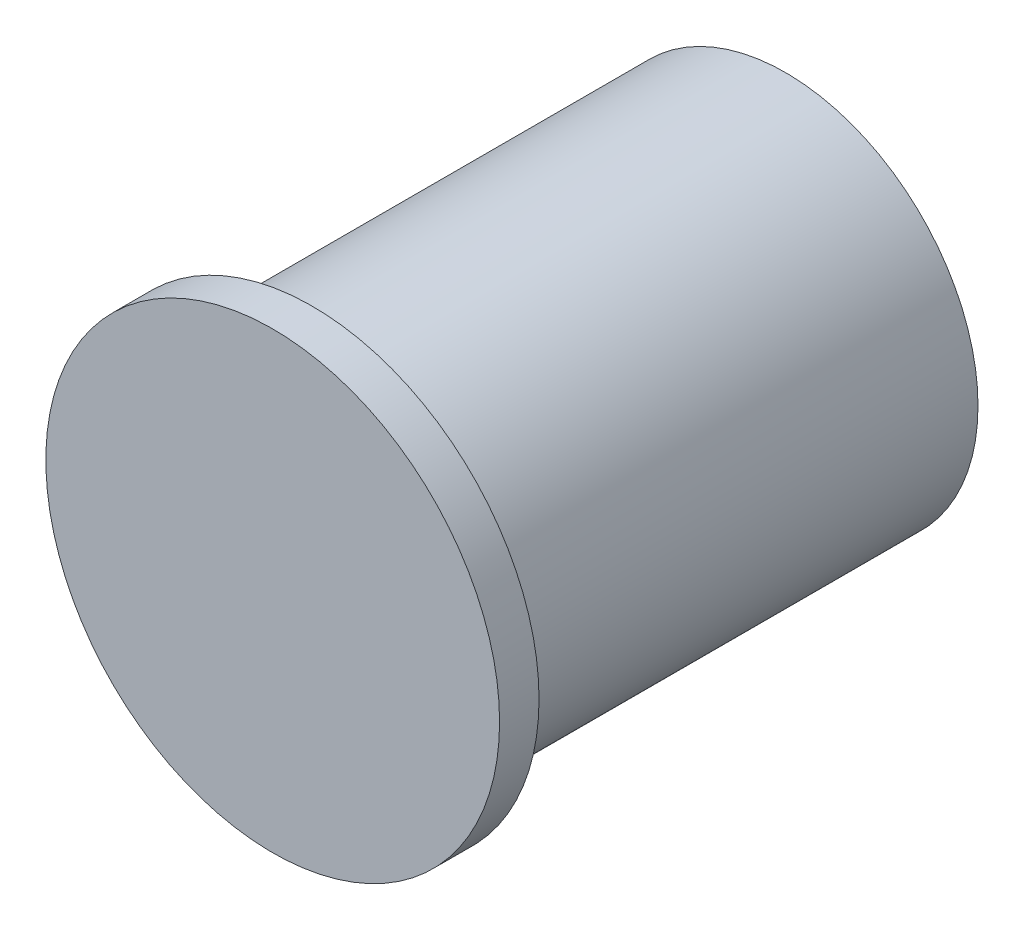
ISO-10303-21;
HEADER;
FILE_DESCRIPTION(('STEP AP214'),'2;1');
FILE_NAME('part.step','',(''),(''),'','','');
FILE_SCHEMA(('AUTOMOTIVE_DESIGN { 1 0 10303 214 1 1 1 1 }'));
ENDSEC;
DATA;
#1=APPLICATION_CONTEXT('core data for automotive mechanical design processes');
#2=APPLICATION_PROTOCOL_DEFINITION('international standard','automotive_design',2000,#1);
#3=PRODUCT_CONTEXT('',#1,'mechanical');
#4=PRODUCT('Part','Part','',(#3));
#5=PRODUCT_RELATED_PRODUCT_CATEGORY('part','',(#4));
#6=PRODUCT_DEFINITION_FORMATION('','',#4);
#7=PRODUCT_DEFINITION_CONTEXT('part definition',#1,'design');
#8=PRODUCT_DEFINITION('design','',#6,#7);
#9=PRODUCT_DEFINITION_SHAPE('','',#8);
#10=(LENGTH_UNIT() NAMED_UNIT(*) SI_UNIT(.MILLI.,.METRE.));
#11=(NAMED_UNIT(*) PLANE_ANGLE_UNIT() SI_UNIT($,.RADIAN.));
#12=(NAMED_UNIT(*) SI_UNIT($,.STERADIAN.) SOLID_ANGLE_UNIT());
#13=UNCERTAINTY_MEASURE_WITH_UNIT(LENGTH_MEASURE(1.E-05),#10,'distance_accuracy_value','');
#14=(GEOMETRIC_REPRESENTATION_CONTEXT(3) GLOBAL_UNCERTAINTY_ASSIGNED_CONTEXT((#13)) GLOBAL_UNIT_ASSIGNED_CONTEXT((#10,
#11,#12)) REPRESENTATION_CONTEXT('',''));
#15=CARTESIAN_POINT('',(0.,0.,0.));
#16=DIRECTION('',(0.,0.,1.));
#17=DIRECTION('',(1.,0.,0.));
#18=AXIS2_PLACEMENT_3D('',#15,#16,#17);
#19=CARTESIAN_POINT('',(0.,0.,24.));
#20=DIRECTION('',(0.,0.,-1.));
#21=DIRECTION('',(-1.,0.,0.));
#22=AXIS2_PLACEMENT_3D('',#19,#20,#21);
#23=CYLINDRICAL_SURFACE('',#22,9.75);
#24=CARTESIAN_POINT('',(0.,0.,24.));
#25=DIRECTION('',(0.,0.,1.));
#26=DIRECTION('',(1.,0.,0.));
#27=AXIS2_PLACEMENT_3D('',#24,#25,#26);
#28=CIRCLE('',#27,9.75);
#29=CARTESIAN_POINT('',(9.75,0.,24.));
#30=VERTEX_POINT('',#29);
#31=EDGE_CURVE('E10',#30,#30,#28,.T.);
#32=ORIENTED_EDGE('',*,*,#31,.F.);
#33=EDGE_LOOP('',(#32));
#34=FACE_BOUND('',#33,.T.);
#35=CARTESIAN_POINT('',(0.,0.,0.));
#36=DIRECTION('',(0.,0.,1.));
#37=DIRECTION('',(1.,0.,0.));
#38=AXIS2_PLACEMENT_3D('',#35,#36,#37);
#39=CIRCLE('',#38,9.75);
#40=CARTESIAN_POINT('',(9.75,0.,0.));
#41=VERTEX_POINT('',#40);
#42=EDGE_CURVE('E36',#41,#41,#39,.T.);
#43=ORIENTED_EDGE('',*,*,#42,.T.);
#44=EDGE_LOOP('',(#43));
#45=FACE_BOUND('',#44,.T.);
#46=ADVANCED_FACE('F33',(#34,#45),#23,.T.);
#47=CARTESIAN_POINT('',(0.,0.,0.));
#48=DIRECTION('',(0.,0.,1.));
#49=DIRECTION('',(1.,0.,0.));
#50=AXIS2_PLACEMENT_3D('',#47,#48,#49);
#51=PLANE('',#50);
#52=CARTESIAN_POINT('',(0.,0.,0.));
#53=DIRECTION('',(0.,0.,-1.));
#54=DIRECTION('',(-1.,0.,0.));
#55=AXIS2_PLACEMENT_3D('',#52,#53,#54);
#56=CIRCLE('',#55,9.);
#57=CARTESIAN_POINT('',(-9.,0.,0.));
#58=VERTEX_POINT('',#57);
#59=EDGE_CURVE('E51',#58,#58,#56,.T.);
#60=ORIENTED_EDGE('',*,*,#59,.F.);
#61=EDGE_LOOP('',(#60));
#62=FACE_BOUND('',#61,.T.);
#63=ORIENTED_EDGE('',*,*,#42,.F.);
#64=EDGE_LOOP('',(#63));
#65=FACE_BOUND('',#64,.T.);
#66=ADVANCED_FACE('F79',(#62,#65),#51,.F.);
#67=CARTESIAN_POINT('',(0.,0.,26.));
#68=DIRECTION('',(0.,0.,-1.));
#69=DIRECTION('',(-1.,0.,0.));
#70=AXIS2_PLACEMENT_3D('',#67,#68,#69);
#71=CYLINDRICAL_SURFACE('',#70,11.5);
#72=CARTESIAN_POINT('',(0.,0.,26.));
#73=DIRECTION('',(0.,0.,1.));
#74=DIRECTION('',(1.,0.,0.));
#75=AXIS2_PLACEMENT_3D('',#72,#73,#74);
#76=CIRCLE('',#75,11.5);
#77=CARTESIAN_POINT('',(11.5,0.,26.));
#78=VERTEX_POINT('',#77);
#79=EDGE_CURVE('E43',#78,#78,#76,.T.);
#80=ORIENTED_EDGE('',*,*,#79,.F.);
#81=EDGE_LOOP('',(#80));
#82=FACE_BOUND('',#81,.T.);
#83=CARTESIAN_POINT('',(0.,0.,24.));
#84=DIRECTION('',(0.,0.,1.));
#85=DIRECTION('',(1.,0.,0.));
#86=AXIS2_PLACEMENT_3D('',#83,#84,#85);
#87=CIRCLE('',#86,11.5);
#88=CARTESIAN_POINT('',(11.5,0.,24.));
#89=VERTEX_POINT('',#88);
#90=EDGE_CURVE('E45',#89,#89,#87,.T.);
#91=ORIENTED_EDGE('',*,*,#90,.T.);
#92=EDGE_LOOP('',(#91));
#93=FACE_BOUND('',#92,.T.);
#94=ADVANCED_FACE('F82',(#82,#93),#71,.T.);
#95=CARTESIAN_POINT('',(0.,0.,26.));
#96=DIRECTION('',(0.,0.,1.));
#97=DIRECTION('',(1.,0.,0.));
#98=AXIS2_PLACEMENT_3D('',#95,#96,#97);
#99=PLANE('',#98);
#100=ORIENTED_EDGE('',*,*,#79,.T.);
#101=EDGE_LOOP('',(#100));
#102=FACE_BOUND('',#101,.T.);
#103=ADVANCED_FACE('F105',(#102),#99,.T.);
#104=CARTESIAN_POINT('',(0.,0.,24.));
#105=DIRECTION('',(0.,0.,1.));
#106=DIRECTION('',(1.,0.,0.));
#107=AXIS2_PLACEMENT_3D('',#104,#105,#106);
#108=PLANE('',#107);
#109=ORIENTED_EDGE('',*,*,#31,.T.);
#110=EDGE_LOOP('',(#109));
#111=FACE_BOUND('',#110,.T.);
#112=ORIENTED_EDGE('',*,*,#90,.F.);
#113=EDGE_LOOP('',(#112));
#114=FACE_BOUND('',#113,.T.);
#115=ADVANCED_FACE('F75',(#111,#114),#108,.F.);
#116=CARTESIAN_POINT('',(0.,0.,2.));
#117=DIRECTION('',(0.,0.,-1.));
#118=DIRECTION('',(-1.,0.,0.));
#119=AXIS2_PLACEMENT_3D('',#116,#117,#118);
#120=CYLINDRICAL_SURFACE('',#119,9.);
#121=CARTESIAN_POINT('',(0.,0.,2.));
#122=DIRECTION('',(0.,0.,-1.));
#123=DIRECTION('',(-1.,0.,0.));
#124=AXIS2_PLACEMENT_3D('',#121,#122,#123);
#125=CIRCLE('',#124,9.);
#126=CARTESIAN_POINT('',(-9.,0.,2.));
#127=VERTEX_POINT('',#126);
#128=EDGE_CURVE('E48',#127,#127,#125,.T.);
#129=ORIENTED_EDGE('',*,*,#128,.F.);
#130=EDGE_LOOP('',(#129));
#131=FACE_BOUND('',#130,.T.);
#132=ORIENTED_EDGE('',*,*,#59,.T.);
#133=EDGE_LOOP('',(#132));
#134=FACE_BOUND('',#133,.T.);
#135=ADVANCED_FACE('F69',(#131,#134),#120,.F.);
#136=CARTESIAN_POINT('',(0.,0.,2.));
#137=DIRECTION('',(0.,0.,-1.));
#138=DIRECTION('',(-1.,0.,0.));
#139=AXIS2_PLACEMENT_3D('',#136,#137,#138);
#140=PLANE('',#139);
#141=CARTESIAN_POINT('',(0.,0.,2.));
#142=DIRECTION('',(0.,0.,-1.));
#143=DIRECTION('',(-1.,0.,0.));
#144=AXIS2_PLACEMENT_3D('',#141,#142,#143);
#145=CIRCLE('',#144,8.);
#146=CARTESIAN_POINT('',(-8.,0.,2.));
#147=VERTEX_POINT('',#146);
#148=EDGE_CURVE('E54',#147,#147,#145,.T.);
#149=ORIENTED_EDGE('',*,*,#148,.F.);
#150=EDGE_LOOP('',(#149));
#151=FACE_BOUND('',#150,.T.);
#152=ORIENTED_EDGE('',*,*,#128,.T.);
#153=EDGE_LOOP('',(#152));
#154=FACE_BOUND('',#153,.T.);
#155=ADVANCED_FACE('F66',(#151,#154),#140,.T.);
#156=CARTESIAN_POINT('',(0.,0.,2.));
#157=DIRECTION('',(0.,0.,-1.));
#158=DIRECTION('',(-1.,0.,0.));
#159=AXIS2_PLACEMENT_3D('',#156,#157,#158);
#160=CYLINDRICAL_SURFACE('',#159,8.);
#161=ORIENTED_EDGE('',*,*,#148,.T.);
#162=EDGE_LOOP('',(#161));
#163=FACE_BOUND('',#162,.T.);
#164=CARTESIAN_POINT('',(0.,0.,0.));
#165=DIRECTION('',(0.,0.,-1.));
#166=DIRECTION('',(-1.,0.,0.));
#167=AXIS2_PLACEMENT_3D('',#164,#165,#166);
#168=CIRCLE('',#167,8.);
#169=CARTESIAN_POINT('',(-8.,0.,0.));
#170=VERTEX_POINT('',#169);
#171=EDGE_CURVE('E57',#170,#170,#168,.T.);
#172=ORIENTED_EDGE('',*,*,#171,.F.);
#173=EDGE_LOOP('',(#172));
#174=FACE_BOUND('',#173,.T.);
#175=ADVANCED_FACE('F63',(#163,#174),#160,.T.);
#176=ORIENTED_EDGE('',*,*,#171,.T.);
#177=EDGE_LOOP('',(#176));
#178=FACE_BOUND('',#177,.T.);
#179=ADVANCED_FACE('F83',(#178),#51,.F.);
#180=CLOSED_SHELL('',(#46,#66,#94,#103,#115,#135,#155,#175,#179));
#181=MANIFOLD_SOLID_BREP('B2',#180);
#182=ADVANCED_BREP_SHAPE_REPRESENTATION('',(#18,#181),#14);
#183=SHAPE_DEFINITION_REPRESENTATION(#9,#182);
ENDSEC;
END-ISO-10303-21;
